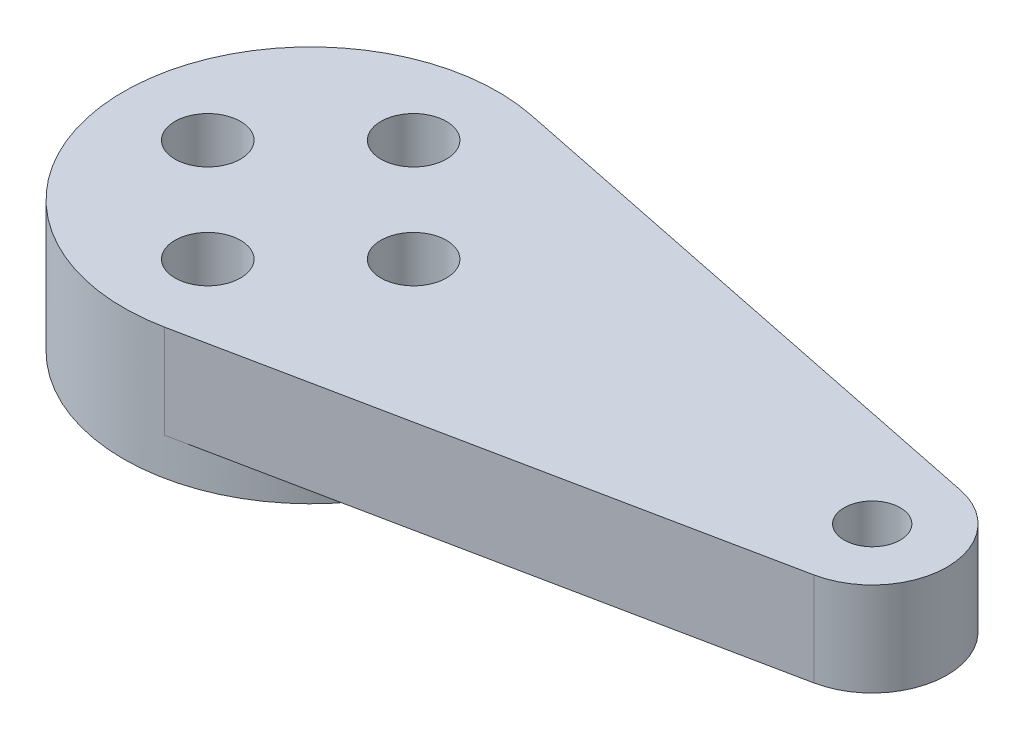
ISO-10303-21;
HEADER;
FILE_DESCRIPTION(('STEP AP214'),'2;1');
FILE_NAME('part.step','',(''),(''),'','','');
FILE_SCHEMA(('AUTOMOTIVE_DESIGN { 1 0 10303 214 1 1 1 1 }'));
ENDSEC;
DATA;
#1=APPLICATION_CONTEXT('core data for automotive mechanical design processes');
#2=APPLICATION_PROTOCOL_DEFINITION('international standard','automotive_design',2000,#1);
#3=PRODUCT_CONTEXT('',#1,'mechanical');
#4=PRODUCT('Part','Part','',(#3));
#5=PRODUCT_RELATED_PRODUCT_CATEGORY('part','',(#4));
#6=PRODUCT_DEFINITION_FORMATION('','',#4);
#7=PRODUCT_DEFINITION_CONTEXT('part definition',#1,'design');
#8=PRODUCT_DEFINITION('design','',#6,#7);
#9=PRODUCT_DEFINITION_SHAPE('','',#8);
#10=(LENGTH_UNIT() NAMED_UNIT(*) SI_UNIT(.MILLI.,.METRE.));
#11=(NAMED_UNIT(*) PLANE_ANGLE_UNIT() SI_UNIT($,.RADIAN.));
#12=(NAMED_UNIT(*) SI_UNIT($,.STERADIAN.) SOLID_ANGLE_UNIT());
#13=UNCERTAINTY_MEASURE_WITH_UNIT(LENGTH_MEASURE(1.E-05),#10,'distance_accuracy_value','');
#14=(GEOMETRIC_REPRESENTATION_CONTEXT(3) GLOBAL_UNCERTAINTY_ASSIGNED_CONTEXT((#13)) GLOBAL_UNIT_ASSIGNED_CONTEXT((#10,
#11,#12)) REPRESENTATION_CONTEXT('',''));
#15=CARTESIAN_POINT('',(0.,0.,0.));
#16=DIRECTION('',(0.,0.,1.));
#17=DIRECTION('',(1.,0.,0.));
#18=AXIS2_PLACEMENT_3D('',#15,#16,#17);
#19=CARTESIAN_POINT('',(0.,7.,0.));
#20=DIRECTION('',(0.,1.,0.));
#21=DIRECTION('',(0.,0.,1.));
#22=AXIS2_PLACEMENT_3D('',#19,#20,#21);
#23=PLANE('',#22);
#24=CARTESIAN_POINT('',(3.10618136515851E-13,7.,5.5));
#25=DIRECTION('',(0.,1.,0.));
#26=DIRECTION('',(0.,0.,1.));
#27=AXIS2_PLACEMENT_3D('',#24,#25,#26);
#28=CIRCLE('',#27,1.75000000000033);
#29=CARTESIAN_POINT('',(3.10618136515851E-13,7.,7.25000000000033));
#30=VERTEX_POINT('',#29);
#31=EDGE_CURVE('E138',#30,#30,#28,.T.);
#32=ORIENTED_EDGE('',*,*,#31,.F.);
#33=EDGE_LOOP('',(#32));
#34=FACE_BOUND('',#33,.T.);
#35=CARTESIAN_POINT('',(0.,7.,-5.5));
#36=DIRECTION('',(0.,1.,0.));
#37=DIRECTION('',(0.,0.,1.));
#38=AXIS2_PLACEMENT_3D('',#35,#36,#37);
#39=CIRCLE('',#38,1.75);
#40=CARTESIAN_POINT('',(0.,7.,-3.75));
#41=VERTEX_POINT('',#40);
#42=EDGE_CURVE('E154',#41,#41,#39,.T.);
#43=ORIENTED_EDGE('',*,*,#42,.F.);
#44=EDGE_LOOP('',(#43));
#45=FACE_BOUND('',#44,.T.);
#46=CARTESIAN_POINT('',(0.,7.,0.));
#47=DIRECTION('',(0.,1.,0.));
#48=DIRECTION('',(0.,0.,1.));
#49=AXIS2_PLACEMENT_3D('',#46,#47,#48);
#50=CIRCLE('',#49,10.);
#51=CARTESIAN_POINT('',(2.,7.,-9.79795897113271));
#52=VERTEX_POINT('',#51);
#53=CARTESIAN_POINT('',(2.,7.,9.79795897113272));
#54=VERTEX_POINT('',#53);
#55=EDGE_CURVE('E11',#52,#54,#50,.T.);
#56=ORIENTED_EDGE('',*,*,#55,.T.);
#57=DIRECTION('',(0.979795897113271,0.,-0.2));
#58=VECTOR('',#57,1.);
#59=CARTESIAN_POINT('',(2.,7.,9.79795897113272));
#60=LINE('',#59,#58);
#61=CARTESIAN_POINT('',(30.8,7.,3.91918358845308));
#62=VERTEX_POINT('',#61);
#63=EDGE_CURVE('E114',#54,#62,#60,.T.);
#64=ORIENTED_EDGE('',*,*,#63,.T.);
#65=CARTESIAN_POINT('',(30.,7.,0.));
#66=DIRECTION('',(0.,1.,0.));
#67=DIRECTION('',(0.,0.,1.));
#68=AXIS2_PLACEMENT_3D('',#65,#66,#67);
#69=CIRCLE('',#68,4.);
#70=CARTESIAN_POINT('',(30.8,7.,-3.91918358845308));
#71=VERTEX_POINT('',#70);
#72=EDGE_CURVE('E95',#62,#71,#69,.T.);
#73=ORIENTED_EDGE('',*,*,#72,.T.);
#74=DIRECTION('',(-0.979795897113271,0.,-0.2));
#75=VECTOR('',#74,1.);
#76=CARTESIAN_POINT('',(2.,7.,-9.79795897113271));
#77=LINE('',#76,#75);
#78=EDGE_CURVE('E56',#71,#52,#77,.T.);
#79=ORIENTED_EDGE('',*,*,#78,.T.);
#80=EDGE_LOOP('',(#56,#64,#73,#79));
#81=FACE_BOUND('',#80,.T.);
#82=CARTESIAN_POINT('',(5.50000000000015,7.,-1.55309068257925E-13));
#83=DIRECTION('',(0.,1.,0.));
#84=DIRECTION('',(0.,0.,1.));
#85=AXIS2_PLACEMENT_3D('',#82,#83,#84);
#86=CIRCLE('',#85,1.75000000000012);
#87=CARTESIAN_POINT('',(5.50000000000015,7.,1.74999999999997));
#88=VERTEX_POINT('',#87);
#89=EDGE_CURVE('E146',#88,#88,#86,.T.);
#90=ORIENTED_EDGE('',*,*,#89,.F.);
#91=EDGE_LOOP('',(#90));
#92=FACE_BOUND('',#91,.T.);
#93=CARTESIAN_POINT('',(-5.49999999999984,7.,1.55982623997457E-13));
#94=DIRECTION('',(0.,1.,0.));
#95=DIRECTION('',(0.,0.,1.));
#96=AXIS2_PLACEMENT_3D('',#93,#94,#95);
#97=CIRCLE('',#96,1.75000000000025);
#98=CARTESIAN_POINT('',(-5.49999999999984,7.,1.75000000000041));
#99=VERTEX_POINT('',#98);
#100=EDGE_CURVE('E130',#99,#99,#97,.T.);
#101=ORIENTED_EDGE('',*,*,#100,.F.);
#102=EDGE_LOOP('',(#101));
#103=FACE_BOUND('',#102,.T.);
#104=CARTESIAN_POINT('',(30.,7.,0.));
#105=DIRECTION('',(0.,1.,0.));
#106=DIRECTION('',(0.,0.,1.));
#107=AXIS2_PLACEMENT_3D('',#104,#105,#106);
#108=CIRCLE('',#107,1.5);
#109=CARTESIAN_POINT('',(30.,7.,1.5));
#110=VERTEX_POINT('',#109);
#111=EDGE_CURVE('E196',#110,#110,#108,.T.);
#112=ORIENTED_EDGE('',*,*,#111,.F.);
#113=EDGE_LOOP('',(#112));
#114=FACE_BOUND('',#113,.T.);
#115=ADVANCED_FACE('F41',(#34,#45,#81,#92,#103,#114),#23,.T.);
#116=CARTESIAN_POINT('',(0.,0.,0.));
#117=DIRECTION('',(0.,1.,0.));
#118=DIRECTION('',(0.,0.,1.));
#119=AXIS2_PLACEMENT_3D('',#116,#117,#118);
#120=PLANE('',#119);
#121=CARTESIAN_POINT('',(0.,0.,0.));
#122=DIRECTION('',(0.,1.,0.));
#123=DIRECTION('',(0.,0.,1.));
#124=AXIS2_PLACEMENT_3D('',#121,#122,#123);
#125=CIRCLE('',#124,10.);
#126=CARTESIAN_POINT('',(0.,0.,10.));
#127=VERTEX_POINT('',#126);
#128=EDGE_CURVE('E45',#127,#127,#125,.T.);
#129=ORIENTED_EDGE('',*,*,#128,.F.);
#130=EDGE_LOOP('',(#129));
#131=FACE_BOUND('',#130,.T.);
#132=CARTESIAN_POINT('',(0.,0.,-5.5));
#133=DIRECTION('',(0.,1.,0.));
#134=DIRECTION('',(0.,0.,1.));
#135=AXIS2_PLACEMENT_3D('',#132,#133,#134);
#136=CIRCLE('',#135,1.75);
#137=CARTESIAN_POINT('',(0.,0.,-3.75));
#138=VERTEX_POINT('',#137);
#139=EDGE_CURVE('E150',#138,#138,#136,.T.);
#140=ORIENTED_EDGE('',*,*,#139,.T.);
#141=EDGE_LOOP('',(#140));
#142=FACE_BOUND('',#141,.T.);
#143=CARTESIAN_POINT('',(5.50000000000015,0.,-1.55309068257925E-13));
#144=DIRECTION('',(0.,1.,0.));
#145=DIRECTION('',(0.,0.,1.));
#146=AXIS2_PLACEMENT_3D('',#143,#144,#145);
#147=CIRCLE('',#146,1.75000000000012);
#148=CARTESIAN_POINT('',(5.50000000000015,0.,1.74999999999997));
#149=VERTEX_POINT('',#148);
#150=EDGE_CURVE('E142',#149,#149,#147,.T.);
#151=ORIENTED_EDGE('',*,*,#150,.T.);
#152=EDGE_LOOP('',(#151));
#153=FACE_BOUND('',#152,.T.);
#154=CARTESIAN_POINT('',(3.10618136515851E-13,0.,5.5));
#155=DIRECTION('',(0.,1.,0.));
#156=DIRECTION('',(0.,0.,1.));
#157=AXIS2_PLACEMENT_3D('',#154,#155,#156);
#158=CIRCLE('',#157,1.75000000000033);
#159=CARTESIAN_POINT('',(3.10618136515851E-13,0.,7.25000000000033));
#160=VERTEX_POINT('',#159);
#161=EDGE_CURVE('E134',#160,#160,#158,.T.);
#162=ORIENTED_EDGE('',*,*,#161,.T.);
#163=EDGE_LOOP('',(#162));
#164=FACE_BOUND('',#163,.T.);
#165=CARTESIAN_POINT('',(-5.49999999999984,0.,1.55982623997457E-13));
#166=DIRECTION('',(0.,1.,0.));
#167=DIRECTION('',(0.,0.,1.));
#168=AXIS2_PLACEMENT_3D('',#165,#166,#167);
#169=CIRCLE('',#168,1.75000000000025);
#170=CARTESIAN_POINT('',(-5.49999999999984,0.,1.75000000000041));
#171=VERTEX_POINT('',#170);
#172=EDGE_CURVE('E125',#171,#171,#169,.T.);
#173=ORIENTED_EDGE('',*,*,#172,.T.);
#174=EDGE_LOOP('',(#173));
#175=FACE_BOUND('',#174,.T.);
#176=ADVANCED_FACE('F162',(#131,#142,#153,#164,#175),#120,.F.);
#177=CARTESIAN_POINT('',(0.,7.,0.));
#178=DIRECTION('',(0.,-1.,0.));
#179=DIRECTION('',(0.,0.,-1.));
#180=AXIS2_PLACEMENT_3D('',#177,#178,#179);
#181=CYLINDRICAL_SURFACE('',#180,10.);
#182=ORIENTED_EDGE('',*,*,#55,.F.);
#183=DIRECTION('',(0.,1.,0.));
#184=VECTOR('',#183,1.);
#185=CARTESIAN_POINT('',(2.,2.,-9.79795897113271));
#186=LINE('',#185,#184);
#187=CARTESIAN_POINT('',(2.,2.,-9.79795897113271));
#188=VERTEX_POINT('',#187);
#189=EDGE_CURVE('E122',#188,#52,#186,.T.);
#190=ORIENTED_EDGE('',*,*,#189,.F.);
#191=CARTESIAN_POINT('',(0.,2.,0.));
#192=DIRECTION('',(0.,-1.,0.));
#193=DIRECTION('',(0.,0.,1.));
#194=AXIS2_PLACEMENT_3D('',#191,#192,#193);
#195=CIRCLE('',#194,10.);
#196=CARTESIAN_POINT('',(2.,2.,9.79795897113272));
#197=VERTEX_POINT('',#196);
#198=EDGE_CURVE('E65',#188,#197,#195,.T.);
#199=ORIENTED_EDGE('',*,*,#198,.T.);
#200=DIRECTION('',(0.,1.,0.));
#201=VECTOR('',#200,1.);
#202=CARTESIAN_POINT('',(2.,2.,9.79795897113272));
#203=LINE('',#202,#201);
#204=EDGE_CURVE('E89',#197,#54,#203,.T.);
#205=ORIENTED_EDGE('',*,*,#204,.T.);
#206=EDGE_LOOP('',(#182,#190,#199,#205));
#207=FACE_BOUND('',#206,.T.);
#208=ORIENTED_EDGE('',*,*,#128,.T.);
#209=EDGE_LOOP('',(#208));
#210=FACE_BOUND('',#209,.T.);
#211=ADVANCED_FACE('F43',(#207,#210),#181,.T.);
#212=CARTESIAN_POINT('',(0.,7.,-5.5));
#213=DIRECTION('',(0.,-1.,0.));
#214=DIRECTION('',(0.,0.,-1.));
#215=AXIS2_PLACEMENT_3D('',#212,#213,#214);
#216=CYLINDRICAL_SURFACE('',#215,1.75);
#217=ORIENTED_EDGE('',*,*,#42,.T.);
#218=EDGE_LOOP('',(#217));
#219=FACE_BOUND('',#218,.T.);
#220=ORIENTED_EDGE('',*,*,#139,.F.);
#221=EDGE_LOOP('',(#220));
#222=FACE_BOUND('',#221,.T.);
#223=ADVANCED_FACE('F165',(#219,#222),#216,.F.);
#224=CARTESIAN_POINT('',(5.50000000000015,7.,-1.55309068257925E-13));
#225=DIRECTION('',(0.,-1.,0.));
#226=DIRECTION('',(0.,0.,-1.));
#227=AXIS2_PLACEMENT_3D('',#224,#225,#226);
#228=CYLINDRICAL_SURFACE('',#227,1.75000000000012);
#229=ORIENTED_EDGE('',*,*,#89,.T.);
#230=EDGE_LOOP('',(#229));
#231=FACE_BOUND('',#230,.T.);
#232=ORIENTED_EDGE('',*,*,#150,.F.);
#233=EDGE_LOOP('',(#232));
#234=FACE_BOUND('',#233,.T.);
#235=ADVANCED_FACE('F167',(#231,#234),#228,.F.);
#236=CARTESIAN_POINT('',(3.10618136515851E-13,7.,5.5));
#237=DIRECTION('',(0.,-1.,0.));
#238=DIRECTION('',(0.,0.,-1.));
#239=AXIS2_PLACEMENT_3D('',#236,#237,#238);
#240=CYLINDRICAL_SURFACE('',#239,1.75000000000033);
#241=ORIENTED_EDGE('',*,*,#31,.T.);
#242=EDGE_LOOP('',(#241));
#243=FACE_BOUND('',#242,.T.);
#244=ORIENTED_EDGE('',*,*,#161,.F.);
#245=EDGE_LOOP('',(#244));
#246=FACE_BOUND('',#245,.T.);
#247=ADVANCED_FACE('F174',(#243,#246),#240,.F.);
#248=CARTESIAN_POINT('',(-5.49999999999984,7.,1.55982623997457E-13));
#249=DIRECTION('',(0.,-1.,0.));
#250=DIRECTION('',(0.,0.,-1.));
#251=AXIS2_PLACEMENT_3D('',#248,#249,#250);
#252=CYLINDRICAL_SURFACE('',#251,1.75000000000025);
#253=ORIENTED_EDGE('',*,*,#100,.T.);
#254=EDGE_LOOP('',(#253));
#255=FACE_BOUND('',#254,.T.);
#256=ORIENTED_EDGE('',*,*,#172,.F.);
#257=EDGE_LOOP('',(#256));
#258=FACE_BOUND('',#257,.T.);
#259=ADVANCED_FACE('F215',(#255,#258),#252,.F.);
#260=CARTESIAN_POINT('',(2.,2.,-9.79795897113271));
#261=DIRECTION('',(0.2,0.,-0.979795897113271));
#262=DIRECTION('',(-0.979795897113271,0.,-0.2));
#263=AXIS2_PLACEMENT_3D('',#260,#261,#262);
#264=PLANE('',#263);
#265=ORIENTED_EDGE('',*,*,#78,.F.);
#266=DIRECTION('',(0.,1.,0.));
#267=VECTOR('',#266,1.);
#268=CARTESIAN_POINT('',(30.8,2.,-3.91918358845308));
#269=LINE('',#268,#267);
#270=CARTESIAN_POINT('',(30.8,2.,-3.91918358845308));
#271=VERTEX_POINT('',#270);
#272=EDGE_CURVE('E83',#271,#71,#269,.T.);
#273=ORIENTED_EDGE('',*,*,#272,.F.);
#274=DIRECTION('',(-0.979795897113271,0.,-0.2));
#275=VECTOR('',#274,1.);
#276=CARTESIAN_POINT('',(2.,2.,-9.79795897113271));
#277=LINE('',#276,#275);
#278=EDGE_CURVE('E101',#271,#188,#277,.T.);
#279=ORIENTED_EDGE('',*,*,#278,.T.);
#280=ORIENTED_EDGE('',*,*,#189,.T.);
#281=EDGE_LOOP('',(#265,#273,#279,#280));
#282=FACE_BOUND('',#281,.T.);
#283=ADVANCED_FACE('F212',(#282),#264,.T.);
#284=CARTESIAN_POINT('',(30.,2.,0.));
#285=DIRECTION('',(0.,1.,0.));
#286=DIRECTION('',(0.,0.,1.));
#287=AXIS2_PLACEMENT_3D('',#284,#285,#286);
#288=CYLINDRICAL_SURFACE('',#287,4.);
#289=ORIENTED_EDGE('',*,*,#72,.F.);
#290=DIRECTION('',(0.,1.,0.));
#291=VECTOR('',#290,1.);
#292=CARTESIAN_POINT('',(30.8,2.,3.91918358845308));
#293=LINE('',#292,#291);
#294=CARTESIAN_POINT('',(30.8,2.,3.91918358845308));
#295=VERTEX_POINT('',#294);
#296=EDGE_CURVE('E91',#295,#62,#293,.T.);
#297=ORIENTED_EDGE('',*,*,#296,.F.);
#298=CARTESIAN_POINT('',(30.,2.,0.));
#299=DIRECTION('',(0.,1.,0.));
#300=DIRECTION('',(0.,0.,1.));
#301=AXIS2_PLACEMENT_3D('',#298,#299,#300);
#302=CIRCLE('',#301,4.);
#303=EDGE_CURVE('E94',#295,#271,#302,.T.);
#304=ORIENTED_EDGE('',*,*,#303,.T.);
#305=ORIENTED_EDGE('',*,*,#272,.T.);
#306=EDGE_LOOP('',(#289,#297,#304,#305));
#307=FACE_BOUND('',#306,.T.);
#308=ADVANCED_FACE('F93',(#307),#288,.T.);
#309=CARTESIAN_POINT('',(2.,2.,9.79795897113272));
#310=DIRECTION('',(0.2,0.,0.979795897113271));
#311=DIRECTION('',(0.979795897113271,0.,-0.2));
#312=AXIS2_PLACEMENT_3D('',#309,#310,#311);
#313=PLANE('',#312);
#314=ORIENTED_EDGE('',*,*,#63,.F.);
#315=ORIENTED_EDGE('',*,*,#204,.F.);
#316=DIRECTION('',(0.979795897113271,0.,-0.2));
#317=VECTOR('',#316,1.);
#318=CARTESIAN_POINT('',(2.,2.,9.79795897113272));
#319=LINE('',#318,#317);
#320=EDGE_CURVE('E100',#197,#295,#319,.T.);
#321=ORIENTED_EDGE('',*,*,#320,.T.);
#322=ORIENTED_EDGE('',*,*,#296,.T.);
#323=EDGE_LOOP('',(#314,#315,#321,#322));
#324=FACE_BOUND('',#323,.T.);
#325=ADVANCED_FACE('F104',(#324),#313,.T.);
#326=CARTESIAN_POINT('',(0.,2.,0.));
#327=DIRECTION('',(0.,1.,0.));
#328=DIRECTION('',(0.,0.,1.));
#329=AXIS2_PLACEMENT_3D('',#326,#327,#328);
#330=PLANE('',#329);
#331=CARTESIAN_POINT('',(30.,2.,0.));
#332=DIRECTION('',(0.,1.,0.));
#333=DIRECTION('',(0.,0.,1.));
#334=AXIS2_PLACEMENT_3D('',#331,#332,#333);
#335=CIRCLE('',#334,1.5);
#336=CARTESIAN_POINT('',(30.,2.,1.5));
#337=VERTEX_POINT('',#336);
#338=EDGE_CURVE('E117',#337,#337,#335,.T.);
#339=ORIENTED_EDGE('',*,*,#338,.T.);
#340=EDGE_LOOP('',(#339));
#341=FACE_BOUND('',#340,.T.);
#342=ORIENTED_EDGE('',*,*,#198,.F.);
#343=ORIENTED_EDGE('',*,*,#278,.F.);
#344=ORIENTED_EDGE('',*,*,#303,.F.);
#345=ORIENTED_EDGE('',*,*,#320,.F.);
#346=EDGE_LOOP('',(#342,#343,#344,#345));
#347=FACE_BOUND('',#346,.T.);
#348=ADVANCED_FACE('F99',(#341,#347),#330,.F.);
#349=CARTESIAN_POINT('',(30.,2.,0.));
#350=DIRECTION('',(0.,1.,0.));
#351=DIRECTION('',(0.,0.,1.));
#352=AXIS2_PLACEMENT_3D('',#349,#350,#351);
#353=CYLINDRICAL_SURFACE('',#352,1.5);
#354=ORIENTED_EDGE('',*,*,#338,.F.);
#355=EDGE_LOOP('',(#354));
#356=FACE_BOUND('',#355,.T.);
#357=ORIENTED_EDGE('',*,*,#111,.T.);
#358=EDGE_LOOP('',(#357));
#359=FACE_BOUND('',#358,.T.);
#360=ADVANCED_FACE('F204',(#356,#359),#353,.F.);
#361=CLOSED_SHELL('',(#115,#176,#211,#223,#235,#247,#259,#283,#308,#325,#348,#360));
#362=MANIFOLD_SOLID_BREP('B2',#361);
#363=ADVANCED_BREP_SHAPE_REPRESENTATION('',(#18,#362),#14);
#364=SHAPE_DEFINITION_REPRESENTATION(#9,#363);
ENDSEC;
END-ISO-10303-21;
